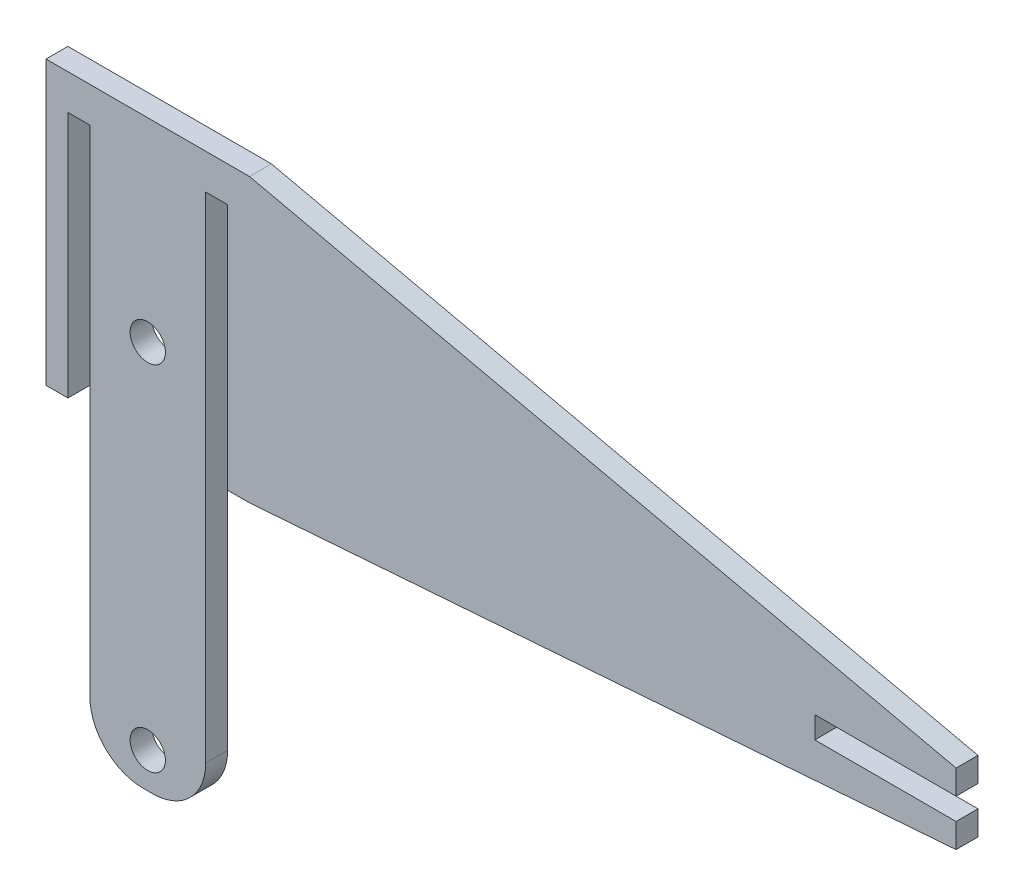
ISO-10303-21;
HEADER;
FILE_DESCRIPTION(('STEP AP214'),'2;1');
FILE_NAME('part.step','',(''),(''),'','','');
FILE_SCHEMA(('AUTOMOTIVE_DESIGN { 1 0 10303 214 1 1 1 1 }'));
ENDSEC;
DATA;
#1=APPLICATION_CONTEXT('core data for automotive mechanical design processes');
#2=APPLICATION_PROTOCOL_DEFINITION('international standard','automotive_design',2000,#1);
#3=PRODUCT_CONTEXT('',#1,'mechanical');
#4=PRODUCT('Part','Part','',(#3));
#5=PRODUCT_RELATED_PRODUCT_CATEGORY('part','',(#4));
#6=PRODUCT_DEFINITION_FORMATION('','',#4);
#7=PRODUCT_DEFINITION_CONTEXT('part definition',#1,'design');
#8=PRODUCT_DEFINITION('design','',#6,#7);
#9=PRODUCT_DEFINITION_SHAPE('','',#8);
#10=(LENGTH_UNIT() NAMED_UNIT(*) SI_UNIT(.MILLI.,.METRE.));
#11=(NAMED_UNIT(*) PLANE_ANGLE_UNIT() SI_UNIT($,.RADIAN.));
#12=(NAMED_UNIT(*) SI_UNIT($,.STERADIAN.) SOLID_ANGLE_UNIT());
#13=UNCERTAINTY_MEASURE_WITH_UNIT(LENGTH_MEASURE(1.E-05),#10,'distance_accuracy_value','');
#14=(GEOMETRIC_REPRESENTATION_CONTEXT(3) GLOBAL_UNCERTAINTY_ASSIGNED_CONTEXT((#13)) GLOBAL_UNIT_ASSIGNED_CONTEXT((#10,
#11,#12)) REPRESENTATION_CONTEXT('',''));
#15=CARTESIAN_POINT('',(0.,0.,0.));
#16=DIRECTION('',(0.,0.,1.));
#17=DIRECTION('',(1.,0.,0.));
#18=AXIS2_PLACEMENT_3D('',#15,#16,#17);
#19=CARTESIAN_POINT('',(-14.4,-20.,3.1));
#20=DIRECTION('',(0.,1.,0.));
#21=DIRECTION('',(0.,0.,1.));
#22=AXIS2_PLACEMENT_3D('',#19,#20,#21);
#23=PLANE('',#22);
#24=DIRECTION('',(1.,0.,0.));
#25=VECTOR('',#24,1.);
#26=CARTESIAN_POINT('',(-14.4,-20.,3.1));
#27=LINE('',#26,#25);
#28=CARTESIAN_POINT('',(11.3,-20.,3.1));
#29=VERTEX_POINT('',#28);
#30=CARTESIAN_POINT('',(14.4,-20.,3.1));
#31=VERTEX_POINT('',#30);
#32=EDGE_CURVE('E195',#29,#31,#27,.T.);
#33=ORIENTED_EDGE('',*,*,#32,.F.);
#34=DIRECTION('',(0.,0.,1.));
#35=VECTOR('',#34,1.);
#36=CARTESIAN_POINT('',(11.3,-20.,0.));
#37=LINE('',#36,#35);
#38=CARTESIAN_POINT('',(11.3,-20.,0.));
#39=VERTEX_POINT('',#38);
#40=EDGE_CURVE('E275',#39,#29,#37,.T.);
#41=ORIENTED_EDGE('',*,*,#40,.F.);
#42=DIRECTION('',(1.,0.,0.));
#43=VECTOR('',#42,1.);
#44=CARTESIAN_POINT('',(-14.4,-20.,0.));
#45=LINE('',#44,#43);
#46=CARTESIAN_POINT('',(14.4,-20.,0.));
#47=VERTEX_POINT('',#46);
#48=EDGE_CURVE('E319',#39,#47,#45,.T.);
#49=ORIENTED_EDGE('',*,*,#48,.T.);
#50=DIRECTION('',(0.,0.,-1.));
#51=VECTOR('',#50,1.);
#52=CARTESIAN_POINT('',(14.4,-20.,3.1));
#53=LINE('',#52,#51);
#54=EDGE_CURVE('E325',#31,#47,#53,.T.);
#55=ORIENTED_EDGE('',*,*,#54,.F.);
#56=EDGE_LOOP('',(#33,#41,#49,#55));
#57=FACE_BOUND('',#56,.T.);
#58=ADVANCED_FACE('F32',(#57),#23,.F.);
#59=CARTESIAN_POINT('',(-14.4,-20.,0.));
#60=VERTEX_POINT('',#59);
#61=CARTESIAN_POINT('',(-11.3,-20.,0.));
#62=VERTEX_POINT('',#61);
#63=EDGE_CURVE('E308',#60,#62,#45,.T.);
#64=ORIENTED_EDGE('',*,*,#63,.T.);
#65=DIRECTION('',(0.,0.,1.));
#66=VECTOR('',#65,1.);
#67=CARTESIAN_POINT('',(-11.3,-20.,0.));
#68=LINE('',#67,#66);
#69=CARTESIAN_POINT('',(-11.3,-20.,3.1));
#70=VERTEX_POINT('',#69);
#71=EDGE_CURVE('E290',#62,#70,#68,.T.);
#72=ORIENTED_EDGE('',*,*,#71,.T.);
#73=CARTESIAN_POINT('',(-14.4,-20.,3.1));
#74=VERTEX_POINT('',#73);
#75=EDGE_CURVE('E310',#74,#70,#27,.T.);
#76=ORIENTED_EDGE('',*,*,#75,.F.);
#77=DIRECTION('',(0.,0.,-1.));
#78=VECTOR('',#77,1.);
#79=CARTESIAN_POINT('',(-14.4,-20.,3.1));
#80=LINE('',#79,#78);
#81=EDGE_CURVE('E322',#74,#60,#80,.T.);
#82=ORIENTED_EDGE('',*,*,#81,.T.);
#83=EDGE_LOOP('',(#64,#72,#76,#82));
#84=FACE_BOUND('',#83,.T.);
#85=ADVANCED_FACE('F392',(#84),#23,.F.);
#86=CARTESIAN_POINT('',(-14.4,-20.,3.1));
#87=DIRECTION('',(-1.,0.,0.));
#88=DIRECTION('',(0.,0.,1.));
#89=AXIS2_PLACEMENT_3D('',#86,#87,#88);
#90=PLANE('',#89);
#91=DIRECTION('',(0.,1.,0.));
#92=VECTOR('',#91,1.);
#93=CARTESIAN_POINT('',(-14.4,-20.,0.));
#94=LINE('',#93,#92);
#95=CARTESIAN_POINT('',(-14.4,20.,0.));
#96=VERTEX_POINT('',#95);
#97=EDGE_CURVE('E298',#60,#96,#94,.T.);
#98=ORIENTED_EDGE('',*,*,#97,.F.);
#99=ORIENTED_EDGE('',*,*,#81,.F.);
#100=DIRECTION('',(0.,1.,0.));
#101=VECTOR('',#100,1.);
#102=CARTESIAN_POINT('',(-14.4,-20.,3.1));
#103=LINE('',#102,#101);
#104=CARTESIAN_POINT('',(-14.4,20.,3.1));
#105=VERTEX_POINT('',#104);
#106=EDGE_CURVE('E304',#74,#105,#103,.T.);
#107=ORIENTED_EDGE('',*,*,#106,.T.);
#108=DIRECTION('',(0.,0.,-1.));
#109=VECTOR('',#108,1.);
#110=CARTESIAN_POINT('',(-14.4,20.,3.1));
#111=LINE('',#110,#109);
#112=EDGE_CURVE('E313',#105,#96,#111,.T.);
#113=ORIENTED_EDGE('',*,*,#112,.T.);
#114=EDGE_LOOP('',(#98,#99,#107,#113));
#115=FACE_BOUND('',#114,.T.);
#116=ADVANCED_FACE('F386',(#115),#90,.T.);
#117=CARTESIAN_POINT('',(-14.4,20.,3.1));
#118=DIRECTION('',(0.,1.,0.));
#119=DIRECTION('',(0.,0.,1.));
#120=AXIS2_PLACEMENT_3D('',#117,#118,#119);
#121=PLANE('',#120);
#122=DIRECTION('',(1.,0.,0.));
#123=VECTOR('',#122,1.);
#124=CARTESIAN_POINT('',(-14.4,20.,0.));
#125=LINE('',#124,#123);
#126=CARTESIAN_POINT('',(14.4,20.,0.));
#127=VERTEX_POINT('',#126);
#128=EDGE_CURVE('E316',#96,#127,#125,.T.);
#129=ORIENTED_EDGE('',*,*,#128,.F.);
#130=ORIENTED_EDGE('',*,*,#112,.F.);
#131=DIRECTION('',(1.,0.,0.));
#132=VECTOR('',#131,1.);
#133=CARTESIAN_POINT('',(-14.4,20.,3.1));
#134=LINE('',#133,#132);
#135=CARTESIAN_POINT('',(14.4,20.,3.1));
#136=VERTEX_POINT('',#135);
#137=EDGE_CURVE('E307',#105,#136,#134,.T.);
#138=ORIENTED_EDGE('',*,*,#137,.T.);
#139=DIRECTION('',(0.,0.,-1.));
#140=VECTOR('',#139,1.);
#141=CARTESIAN_POINT('',(14.4,20.,3.1));
#142=LINE('',#141,#140);
#143=EDGE_CURVE('E327',#136,#127,#142,.T.);
#144=ORIENTED_EDGE('',*,*,#143,.T.);
#145=EDGE_LOOP('',(#129,#130,#138,#144));
#146=FACE_BOUND('',#145,.T.);
#147=ADVANCED_FACE('F382',(#146),#121,.T.);
#148=CARTESIAN_POINT('',(0.,0.,3.1));
#149=DIRECTION('',(0.,0.,-1.));
#150=DIRECTION('',(-1.,0.,0.));
#151=AXIS2_PLACEMENT_3D('',#148,#149,#150);
#152=PLANE('',#151);
#153=CARTESIAN_POINT('',(0.,-7.5,3.1));
#154=DIRECTION('',(0.,0.,1.));
#155=DIRECTION('',(1.,0.,0.));
#156=AXIS2_PLACEMENT_3D('',#153,#154,#155);
#157=CIRCLE('',#156,2.5);
#158=CARTESIAN_POINT('',(2.5,-7.5,3.1));
#159=VERTEX_POINT('',#158);
#160=EDGE_CURVE('E251',#159,#159,#157,.T.);
#161=ORIENTED_EDGE('',*,*,#160,.F.);
#162=EDGE_LOOP('',(#161));
#163=FACE_BOUND('',#162,.T.);
#164=DIRECTION('',(1.,0.,0.));
#165=VECTOR('',#164,1.);
#166=CARTESIAN_POINT('',(-8.19999999999999,-62.5,3.1));
#167=LINE('',#166,#165);
#168=CARTESIAN_POINT('',(-0.699999999999985,-62.5,3.1));
#169=VERTEX_POINT('',#168);
#170=CARTESIAN_POINT('',(0.699999999999982,-62.5,3.1));
#171=VERTEX_POINT('',#170);
#172=EDGE_CURVE('E245',#169,#171,#167,.T.);
#173=ORIENTED_EDGE('',*,*,#172,.T.);
#174=CARTESIAN_POINT('',(0.699999999999982,-55.,3.1));
#175=DIRECTION('',(0.,0.,-1.));
#176=DIRECTION('',(-1.,0.,0.));
#177=AXIS2_PLACEMENT_3D('',#174,#175,#176);
#178=CIRCLE('',#177,7.5);
#179=CARTESIAN_POINT('',(8.19999999999998,-55.,3.1));
#180=VERTEX_POINT('',#179);
#181=EDGE_CURVE('E336',#171,#180,#178,.F.);
#182=ORIENTED_EDGE('',*,*,#181,.T.);
#183=DIRECTION('',(0.,-1.,0.));
#184=VECTOR('',#183,1.);
#185=CARTESIAN_POINT('',(8.19999999999999,-20.,3.1));
#186=LINE('',#185,#184);
#187=CARTESIAN_POINT('',(8.2,15.,3.1));
#188=VERTEX_POINT('',#187);
#189=EDGE_CURVE('E263',#188,#180,#186,.T.);
#190=ORIENTED_EDGE('',*,*,#189,.F.);
#191=DIRECTION('',(-1.,0.,0.));
#192=VECTOR('',#191,1.);
#193=CARTESIAN_POINT('',(11.3,15.,3.1));
#194=LINE('',#193,#192);
#195=CARTESIAN_POINT('',(11.3,15.,3.1));
#196=VERTEX_POINT('',#195);
#197=EDGE_CURVE('E271',#196,#188,#194,.T.);
#198=ORIENTED_EDGE('',*,*,#197,.F.);
#199=DIRECTION('',(0.,1.,0.));
#200=VECTOR('',#199,1.);
#201=CARTESIAN_POINT('',(11.3,-20.,3.1));
#202=LINE('',#201,#200);
#203=EDGE_CURVE('E256',#29,#196,#202,.T.);
#204=ORIENTED_EDGE('',*,*,#203,.F.);
#205=ORIENTED_EDGE('',*,*,#32,.T.);
#206=DIRECTION('',(-0.997199309888456,-0.0747899482416341,0.));
#207=VECTOR('',#206,1.);
#208=CARTESIAN_POINT('',(114.4,-12.5,3.1));
#209=LINE('',#208,#207);
#210=CARTESIAN_POINT('',(114.4,-12.5,3.1));
#211=VERTEX_POINT('',#210);
#212=EDGE_CURVE('E175',#211,#31,#209,.T.);
#213=ORIENTED_EDGE('',*,*,#212,.F.);
#214=DIRECTION('',(0.,-1.,0.));
#215=VECTOR('',#214,1.);
#216=CARTESIAN_POINT('',(114.4,-9.05000000000002,3.1));
#217=LINE('',#216,#215);
#218=CARTESIAN_POINT('',(114.4,-9.05000000000002,3.1));
#219=VERTEX_POINT('',#218);
#220=EDGE_CURVE('E191',#219,#211,#217,.T.);
#221=ORIENTED_EDGE('',*,*,#220,.F.);
#222=DIRECTION('',(1.,0.,0.));
#223=VECTOR('',#222,1.);
#224=CARTESIAN_POINT('',(94.4,-9.05000000000001,3.1));
#225=LINE('',#224,#223);
#226=CARTESIAN_POINT('',(94.4,-9.05000000000001,3.1));
#227=VERTEX_POINT('',#226);
#228=EDGE_CURVE('E183',#227,#219,#225,.T.);
#229=ORIENTED_EDGE('',*,*,#228,.F.);
#230=DIRECTION('',(0.,-1.,0.));
#231=VECTOR('',#230,1.);
#232=CARTESIAN_POINT('',(94.4,-9.05000000000001,3.1));
#233=LINE('',#232,#231);
#234=CARTESIAN_POINT('',(94.4,-5.95000000000001,3.1));
#235=VERTEX_POINT('',#234);
#236=EDGE_CURVE('E215',#235,#227,#233,.T.);
#237=ORIENTED_EDGE('',*,*,#236,.F.);
#238=DIRECTION('',(-1.,0.,0.));
#239=VECTOR('',#238,1.);
#240=CARTESIAN_POINT('',(94.4,-5.95000000000001,3.1));
#241=LINE('',#240,#239);
#242=CARTESIAN_POINT('',(114.4,-5.95000000000002,3.1));
#243=VERTEX_POINT('',#242);
#244=EDGE_CURVE('E212',#243,#235,#241,.T.);
#245=ORIENTED_EDGE('',*,*,#244,.F.);
#246=DIRECTION('',(0.,-1.,0.));
#247=VECTOR('',#246,1.);
#248=CARTESIAN_POINT('',(114.4,-5.95000000000002,3.1));
#249=LINE('',#248,#247);
#250=CARTESIAN_POINT('',(114.4,-2.50000000000002,3.1));
#251=VERTEX_POINT('',#250);
#252=EDGE_CURVE('E209',#251,#243,#249,.T.);
#253=ORIENTED_EDGE('',*,*,#252,.F.);
#254=DIRECTION('',(0.975609756097561,-0.219512195121951,0.));
#255=VECTOR('',#254,1.);
#256=CARTESIAN_POINT('',(114.4,-2.50000000000002,3.1));
#257=LINE('',#256,#255);
#258=EDGE_CURVE('E197',#136,#251,#257,.T.);
#259=ORIENTED_EDGE('',*,*,#258,.F.);
#260=ORIENTED_EDGE('',*,*,#137,.F.);
#261=ORIENTED_EDGE('',*,*,#106,.F.);
#262=ORIENTED_EDGE('',*,*,#75,.T.);
#263=DIRECTION('',(0.,-1.,0.));
#264=VECTOR('',#263,1.);
#265=CARTESIAN_POINT('',(-11.3,-20.,3.1));
#266=LINE('',#265,#264);
#267=CARTESIAN_POINT('',(-11.3,15.,3.1));
#268=VERTEX_POINT('',#267);
#269=EDGE_CURVE('E277',#268,#70,#266,.T.);
#270=ORIENTED_EDGE('',*,*,#269,.F.);
#271=DIRECTION('',(-1.,0.,0.));
#272=VECTOR('',#271,1.);
#273=CARTESIAN_POINT('',(-11.3,15.,3.1));
#274=LINE('',#273,#272);
#275=CARTESIAN_POINT('',(-8.2,15.,3.1));
#276=VERTEX_POINT('',#275);
#277=EDGE_CURVE('E285',#276,#268,#274,.T.);
#278=ORIENTED_EDGE('',*,*,#277,.F.);
#279=DIRECTION('',(0.,1.,0.));
#280=VECTOR('',#279,1.);
#281=CARTESIAN_POINT('',(-8.19999999999999,-20.,3.1));
#282=LINE('',#281,#280);
#283=CARTESIAN_POINT('',(-8.19999999999998,-55.,3.1));
#284=VERTEX_POINT('',#283);
#285=EDGE_CURVE('E292',#284,#276,#282,.T.);
#286=ORIENTED_EDGE('',*,*,#285,.F.);
#287=CARTESIAN_POINT('',(-0.699999999999985,-55.,3.1));
#288=DIRECTION('',(0.,0.,-1.));
#289=DIRECTION('',(-1.,0.,0.));
#290=AXIS2_PLACEMENT_3D('',#287,#288,#289);
#291=CIRCLE('',#290,7.5);
#292=EDGE_CURVE('E334',#284,#169,#291,.F.);
#293=ORIENTED_EDGE('',*,*,#292,.T.);
#294=EDGE_LOOP('',(#173,#182,#190,#198,#204,#205,#213,#221,#229,#237,#245,#253,#259,#260,#261,
#262,#270,#278,#286,#293));
#295=FACE_BOUND('',#294,.T.);
#296=CARTESIAN_POINT('',(0.,-57.5,3.1));
#297=DIRECTION('',(0.,0.,1.));
#298=DIRECTION('',(1.,0.,0.));
#299=AXIS2_PLACEMENT_3D('',#296,#297,#298);
#300=CIRCLE('',#299,2.5);
#301=CARTESIAN_POINT('',(2.5,-57.5,3.1));
#302=VERTEX_POINT('',#301);
#303=EDGE_CURVE('E234',#302,#302,#300,.T.);
#304=ORIENTED_EDGE('',*,*,#303,.F.);
#305=EDGE_LOOP('',(#304));
#306=FACE_BOUND('',#305,.T.);
#307=ADVANCED_FACE('F188',(#163,#295,#306),#152,.F.);
#308=CARTESIAN_POINT('',(0.,0.,0.));
#309=DIRECTION('',(0.,0.,-1.));
#310=DIRECTION('',(-1.,0.,0.));
#311=AXIS2_PLACEMENT_3D('',#308,#309,#310);
#312=PLANE('',#311);
#313=CARTESIAN_POINT('',(0.,-7.5,0.));
#314=DIRECTION('',(0.,0.,1.));
#315=DIRECTION('',(1.,0.,0.));
#316=AXIS2_PLACEMENT_3D('',#313,#314,#315);
#317=CIRCLE('',#316,2.5);
#318=CARTESIAN_POINT('',(2.5,-7.5,0.));
#319=VERTEX_POINT('',#318);
#320=EDGE_CURVE('E253',#319,#319,#317,.T.);
#321=ORIENTED_EDGE('',*,*,#320,.T.);
#322=EDGE_LOOP('',(#321));
#323=FACE_BOUND('',#322,.T.);
#324=DIRECTION('',(0.,-1.,0.));
#325=VECTOR('',#324,1.);
#326=CARTESIAN_POINT('',(8.19999999999999,-20.,0.));
#327=LINE('',#326,#325);
#328=CARTESIAN_POINT('',(8.2,15.,0.));
#329=VERTEX_POINT('',#328);
#330=CARTESIAN_POINT('',(8.19999999999998,-55.,0.));
#331=VERTEX_POINT('',#330);
#332=EDGE_CURVE('E266',#329,#331,#327,.T.);
#333=ORIENTED_EDGE('',*,*,#332,.T.);
#334=CARTESIAN_POINT('',(0.699999999999982,-55.,0.));
#335=DIRECTION('',(0.,0.,-1.));
#336=DIRECTION('',(-1.,0.,0.));
#337=AXIS2_PLACEMENT_3D('',#334,#335,#336);
#338=CIRCLE('',#337,7.5);
#339=CARTESIAN_POINT('',(0.699999999999982,-62.5,0.));
#340=VERTEX_POINT('',#339);
#341=EDGE_CURVE('E40',#331,#340,#338,.T.);
#342=ORIENTED_EDGE('',*,*,#341,.T.);
#343=DIRECTION('',(1.,0.,0.));
#344=VECTOR('',#343,1.);
#345=CARTESIAN_POINT('',(-8.19999999999999,-62.5,0.));
#346=LINE('',#345,#344);
#347=CARTESIAN_POINT('',(-0.699999999999985,-62.5,0.));
#348=VERTEX_POINT('',#347);
#349=EDGE_CURVE('E248',#348,#340,#346,.T.);
#350=ORIENTED_EDGE('',*,*,#349,.F.);
#351=CARTESIAN_POINT('',(-0.699999999999985,-55.,0.));
#352=DIRECTION('',(0.,0.,-1.));
#353=DIRECTION('',(-1.,0.,0.));
#354=AXIS2_PLACEMENT_3D('',#351,#352,#353);
#355=CIRCLE('',#354,7.5);
#356=CARTESIAN_POINT('',(-8.19999999999998,-55.,0.));
#357=VERTEX_POINT('',#356);
#358=EDGE_CURVE('E47',#348,#357,#355,.T.);
#359=ORIENTED_EDGE('',*,*,#358,.T.);
#360=DIRECTION('',(0.,1.,0.));
#361=VECTOR('',#360,1.);
#362=CARTESIAN_POINT('',(-8.19999999999999,-20.,0.));
#363=LINE('',#362,#361);
#364=CARTESIAN_POINT('',(-8.2,15.,0.));
#365=VERTEX_POINT('',#364);
#366=EDGE_CURVE('E284',#357,#365,#363,.T.);
#367=ORIENTED_EDGE('',*,*,#366,.T.);
#368=DIRECTION('',(-1.,0.,0.));
#369=VECTOR('',#368,1.);
#370=CARTESIAN_POINT('',(-11.3,15.,0.));
#371=LINE('',#370,#369);
#372=CARTESIAN_POINT('',(-11.3,15.,0.));
#373=VERTEX_POINT('',#372);
#374=EDGE_CURVE('E287',#365,#373,#371,.T.);
#375=ORIENTED_EDGE('',*,*,#374,.T.);
#376=DIRECTION('',(0.,-1.,0.));
#377=VECTOR('',#376,1.);
#378=CARTESIAN_POINT('',(-11.3,-20.,0.));
#379=LINE('',#378,#377);
#380=EDGE_CURVE('E281',#373,#62,#379,.T.);
#381=ORIENTED_EDGE('',*,*,#380,.T.);
#382=ORIENTED_EDGE('',*,*,#63,.F.);
#383=ORIENTED_EDGE('',*,*,#97,.T.);
#384=ORIENTED_EDGE('',*,*,#128,.T.);
#385=DIRECTION('',(0.975609756097561,-0.219512195121951,0.));
#386=VECTOR('',#385,1.);
#387=CARTESIAN_POINT('',(114.4,-2.50000000000002,0.));
#388=LINE('',#387,#386);
#389=CARTESIAN_POINT('',(114.4,-2.50000000000002,0.));
#390=VERTEX_POINT('',#389);
#391=EDGE_CURVE('E222',#127,#390,#388,.T.);
#392=ORIENTED_EDGE('',*,*,#391,.T.);
#393=DIRECTION('',(0.,-1.,0.));
#394=VECTOR('',#393,1.);
#395=CARTESIAN_POINT('',(114.4,-5.95000000000002,0.));
#396=LINE('',#395,#394);
#397=CARTESIAN_POINT('',(114.4,-5.95000000000002,0.));
#398=VERTEX_POINT('',#397);
#399=EDGE_CURVE('E225',#390,#398,#396,.T.);
#400=ORIENTED_EDGE('',*,*,#399,.T.);
#401=DIRECTION('',(-1.,0.,0.));
#402=VECTOR('',#401,1.);
#403=CARTESIAN_POINT('',(94.4,-5.95000000000001,0.));
#404=LINE('',#403,#402);
#405=CARTESIAN_POINT('',(94.4,-5.95000000000001,0.));
#406=VERTEX_POINT('',#405);
#407=EDGE_CURVE('E228',#398,#406,#404,.T.);
#408=ORIENTED_EDGE('',*,*,#407,.T.);
#409=DIRECTION('',(0.,-1.,0.));
#410=VECTOR('',#409,1.);
#411=CARTESIAN_POINT('',(94.4,-9.05000000000001,0.));
#412=LINE('',#411,#410);
#413=CARTESIAN_POINT('',(94.4,-9.05000000000001,0.));
#414=VERTEX_POINT('',#413);
#415=EDGE_CURVE('E204',#406,#414,#412,.T.);
#416=ORIENTED_EDGE('',*,*,#415,.T.);
#417=DIRECTION('',(1.,0.,0.));
#418=VECTOR('',#417,1.);
#419=CARTESIAN_POINT('',(94.4,-9.05000000000001,0.));
#420=LINE('',#419,#418);
#421=CARTESIAN_POINT('',(114.4,-9.05000000000002,0.));
#422=VERTEX_POINT('',#421);
#423=EDGE_CURVE('E201',#414,#422,#420,.T.);
#424=ORIENTED_EDGE('',*,*,#423,.T.);
#425=DIRECTION('',(0.,-1.,0.));
#426=VECTOR('',#425,1.);
#427=CARTESIAN_POINT('',(114.4,-9.05000000000002,0.));
#428=LINE('',#427,#426);
#429=CARTESIAN_POINT('',(114.4,-12.5,0.));
#430=VERTEX_POINT('',#429);
#431=EDGE_CURVE('E219',#422,#430,#428,.T.);
#432=ORIENTED_EDGE('',*,*,#431,.T.);
#433=DIRECTION('',(-0.997199309888456,-0.0747899482416341,0.));
#434=VECTOR('',#433,1.);
#435=CARTESIAN_POINT('',(114.4,-12.5,0.));
#436=LINE('',#435,#434);
#437=EDGE_CURVE('E177',#430,#47,#436,.T.);
#438=ORIENTED_EDGE('',*,*,#437,.T.);
#439=ORIENTED_EDGE('',*,*,#48,.F.);
#440=DIRECTION('',(0.,1.,0.));
#441=VECTOR('',#440,1.);
#442=CARTESIAN_POINT('',(11.3,-20.,0.));
#443=LINE('',#442,#441);
#444=CARTESIAN_POINT('',(11.3,15.,0.));
#445=VERTEX_POINT('',#444);
#446=EDGE_CURVE('E259',#39,#445,#443,.T.);
#447=ORIENTED_EDGE('',*,*,#446,.T.);
#448=DIRECTION('',(-1.,0.,0.));
#449=VECTOR('',#448,1.);
#450=CARTESIAN_POINT('',(11.3,15.,0.));
#451=LINE('',#450,#449);
#452=EDGE_CURVE('E262',#445,#329,#451,.T.);
#453=ORIENTED_EDGE('',*,*,#452,.T.);
#454=EDGE_LOOP('',(#333,#342,#350,#359,#367,#375,#381,#382,#383,#384,#392,#400,#408,#416,#424,
#432,#438,#439,#447,#453));
#455=FACE_BOUND('',#454,.T.);
#456=CARTESIAN_POINT('',(0.,-57.5,0.));
#457=DIRECTION('',(0.,0.,1.));
#458=DIRECTION('',(1.,0.,0.));
#459=AXIS2_PLACEMENT_3D('',#456,#457,#458);
#460=CIRCLE('',#459,2.5);
#461=CARTESIAN_POINT('',(2.5,-57.5,0.));
#462=VERTEX_POINT('',#461);
#463=EDGE_CURVE('E242',#462,#462,#460,.T.);
#464=ORIENTED_EDGE('',*,*,#463,.T.);
#465=EDGE_LOOP('',(#464));
#466=FACE_BOUND('',#465,.T.);
#467=ADVANCED_FACE('F340',(#323,#455,#466),#312,.T.);
#468=CARTESIAN_POINT('',(-11.3,-20.,0.));
#469=DIRECTION('',(-1.,0.,0.));
#470=DIRECTION('',(0.,0.,1.));
#471=AXIS2_PLACEMENT_3D('',#468,#469,#470);
#472=PLANE('',#471);
#473=ORIENTED_EDGE('',*,*,#269,.T.);
#474=ORIENTED_EDGE('',*,*,#71,.F.);
#475=ORIENTED_EDGE('',*,*,#380,.F.);
#476=DIRECTION('',(0.,0.,1.));
#477=VECTOR('',#476,1.);
#478=CARTESIAN_POINT('',(-11.3,15.,0.));
#479=LINE('',#478,#477);
#480=EDGE_CURVE('E296',#373,#268,#479,.T.);
#481=ORIENTED_EDGE('',*,*,#480,.T.);
#482=EDGE_LOOP('',(#473,#474,#475,#481));
#483=FACE_BOUND('',#482,.T.);
#484=ADVANCED_FACE('F395',(#483),#472,.F.);
#485=CARTESIAN_POINT('',(-11.3,15.,0.));
#486=DIRECTION('',(0.,1.,0.));
#487=DIRECTION('',(0.,0.,1.));
#488=AXIS2_PLACEMENT_3D('',#485,#486,#487);
#489=PLANE('',#488);
#490=ORIENTED_EDGE('',*,*,#277,.T.);
#491=ORIENTED_EDGE('',*,*,#480,.F.);
#492=ORIENTED_EDGE('',*,*,#374,.F.);
#493=DIRECTION('',(0.,0.,1.));
#494=VECTOR('',#493,1.);
#495=CARTESIAN_POINT('',(-8.2,15.,0.));
#496=LINE('',#495,#494);
#497=EDGE_CURVE('E299',#365,#276,#496,.T.);
#498=ORIENTED_EDGE('',*,*,#497,.T.);
#499=EDGE_LOOP('',(#490,#491,#492,#498));
#500=FACE_BOUND('',#499,.T.);
#501=ADVANCED_FACE('F399',(#500),#489,.F.);
#502=CARTESIAN_POINT('',(-8.19999999999999,-20.,0.));
#503=DIRECTION('',(1.,0.,0.));
#504=DIRECTION('',(0.,1.,0.));
#505=AXIS2_PLACEMENT_3D('',#502,#503,#504);
#506=PLANE('',#505);
#507=ORIENTED_EDGE('',*,*,#366,.F.);
#508=DIRECTION('',(0.,0.,1.));
#509=VECTOR('',#508,1.);
#510=CARTESIAN_POINT('',(-8.19999999999998,-55.,3.1));
#511=LINE('',#510,#509);
#512=EDGE_CURVE('E11',#357,#284,#511,.T.);
#513=ORIENTED_EDGE('',*,*,#512,.T.);
#514=ORIENTED_EDGE('',*,*,#285,.T.);
#515=ORIENTED_EDGE('',*,*,#497,.F.);
#516=EDGE_LOOP('',(#507,#513,#514,#515));
#517=FACE_BOUND('',#516,.T.);
#518=ADVANCED_FACE('F401',(#517),#506,.F.);
#519=CARTESIAN_POINT('',(11.3,-20.,0.));
#520=DIRECTION('',(1.,0.,0.));
#521=DIRECTION('',(0.,0.,-1.));
#522=AXIS2_PLACEMENT_3D('',#519,#520,#521);
#523=PLANE('',#522);
#524=ORIENTED_EDGE('',*,*,#203,.T.);
#525=DIRECTION('',(0.,0.,1.));
#526=VECTOR('',#525,1.);
#527=CARTESIAN_POINT('',(11.3,15.,0.));
#528=LINE('',#527,#526);
#529=EDGE_CURVE('E268',#445,#196,#528,.T.);
#530=ORIENTED_EDGE('',*,*,#529,.F.);
#531=ORIENTED_EDGE('',*,*,#446,.F.);
#532=ORIENTED_EDGE('',*,*,#40,.T.);
#533=EDGE_LOOP('',(#524,#530,#531,#532));
#534=FACE_BOUND('',#533,.T.);
#535=ADVANCED_FACE('F463',(#534),#523,.F.);
#536=CARTESIAN_POINT('',(8.19999999999999,-20.,0.));
#537=DIRECTION('',(-1.,0.,0.));
#538=DIRECTION('',(0.,-1.,0.));
#539=AXIS2_PLACEMENT_3D('',#536,#537,#538);
#540=PLANE('',#539);
#541=ORIENTED_EDGE('',*,*,#189,.T.);
#542=DIRECTION('',(0.,0.,1.));
#543=VECTOR('',#542,1.);
#544=CARTESIAN_POINT('',(8.19999999999998,-55.,0.));
#545=LINE('',#544,#543);
#546=EDGE_CURVE('E55',#180,#331,#545,.F.);
#547=ORIENTED_EDGE('',*,*,#546,.T.);
#548=ORIENTED_EDGE('',*,*,#332,.F.);
#549=DIRECTION('',(0.,0.,1.));
#550=VECTOR('',#549,1.);
#551=CARTESIAN_POINT('',(8.2,15.,0.));
#552=LINE('',#551,#550);
#553=EDGE_CURVE('E278',#329,#188,#552,.T.);
#554=ORIENTED_EDGE('',*,*,#553,.T.);
#555=EDGE_LOOP('',(#541,#547,#548,#554));
#556=FACE_BOUND('',#555,.T.);
#557=ADVANCED_FACE('F351',(#556),#540,.F.);
#558=CARTESIAN_POINT('',(11.3,15.,0.));
#559=DIRECTION('',(0.,1.,0.));
#560=DIRECTION('',(0.,0.,1.));
#561=AXIS2_PLACEMENT_3D('',#558,#559,#560);
#562=PLANE('',#561);
#563=ORIENTED_EDGE('',*,*,#197,.T.);
#564=ORIENTED_EDGE('',*,*,#553,.F.);
#565=ORIENTED_EDGE('',*,*,#452,.F.);
#566=ORIENTED_EDGE('',*,*,#529,.T.);
#567=EDGE_LOOP('',(#563,#564,#565,#566));
#568=FACE_BOUND('',#567,.T.);
#569=ADVANCED_FACE('F355',(#568),#562,.F.);
#570=CARTESIAN_POINT('',(0.,-7.5,0.));
#571=DIRECTION('',(0.,0.,1.));
#572=DIRECTION('',(1.,0.,0.));
#573=AXIS2_PLACEMENT_3D('',#570,#571,#572);
#574=CYLINDRICAL_SURFACE('',#573,2.5);
#575=ORIENTED_EDGE('',*,*,#320,.F.);
#576=EDGE_LOOP('',(#575));
#577=FACE_BOUND('',#576,.T.);
#578=ORIENTED_EDGE('',*,*,#160,.T.);
#579=EDGE_LOOP('',(#578));
#580=FACE_BOUND('',#579,.T.);
#581=ADVANCED_FACE('F483',(#577,#580),#574,.F.);
#582=CARTESIAN_POINT('',(-8.19999999999999,-62.5,0.));
#583=DIRECTION('',(0.,-1.,0.));
#584=DIRECTION('',(0.,0.,-1.));
#585=AXIS2_PLACEMENT_3D('',#582,#583,#584);
#586=PLANE('',#585);
#587=ORIENTED_EDGE('',*,*,#349,.T.);
#588=DIRECTION('',(0.,0.,1.));
#589=VECTOR('',#588,1.);
#590=CARTESIAN_POINT('',(0.699999999999982,-62.5,3.1));
#591=LINE('',#590,#589);
#592=EDGE_CURVE('E331',#340,#171,#591,.T.);
#593=ORIENTED_EDGE('',*,*,#592,.T.);
#594=ORIENTED_EDGE('',*,*,#172,.F.);
#595=DIRECTION('',(0.,0.,1.));
#596=VECTOR('',#595,1.);
#597=CARTESIAN_POINT('',(-0.699999999999985,-62.5,0.));
#598=LINE('',#597,#596);
#599=EDGE_CURVE('E324',#169,#348,#598,.F.);
#600=ORIENTED_EDGE('',*,*,#599,.T.);
#601=EDGE_LOOP('',(#587,#593,#594,#600));
#602=FACE_BOUND('',#601,.T.);
#603=ADVANCED_FACE('F345',(#602),#586,.T.);
#604=CARTESIAN_POINT('',(0.,-57.5,0.));
#605=DIRECTION('',(0.,0.,1.));
#606=DIRECTION('',(1.,0.,0.));
#607=AXIS2_PLACEMENT_3D('',#604,#605,#606);
#608=CYLINDRICAL_SURFACE('',#607,2.5);
#609=ORIENTED_EDGE('',*,*,#463,.F.);
#610=EDGE_LOOP('',(#609));
#611=FACE_BOUND('',#610,.T.);
#612=ORIENTED_EDGE('',*,*,#303,.T.);
#613=EDGE_LOOP('',(#612));
#614=FACE_BOUND('',#613,.T.);
#615=ADVANCED_FACE('F411',(#611,#614),#608,.F.);
#616=CARTESIAN_POINT('',(0.699999999999982,-55.,0.));
#617=DIRECTION('',(0.,0.,-1.));
#618=DIRECTION('',(-1.,0.,0.));
#619=AXIS2_PLACEMENT_3D('',#616,#617,#618);
#620=CYLINDRICAL_SURFACE('',#619,7.5);
#621=ORIENTED_EDGE('',*,*,#341,.F.);
#622=ORIENTED_EDGE('',*,*,#546,.F.);
#623=ORIENTED_EDGE('',*,*,#181,.F.);
#624=ORIENTED_EDGE('',*,*,#592,.F.);
#625=EDGE_LOOP('',(#621,#622,#623,#624));
#626=FACE_BOUND('',#625,.T.);
#627=ADVANCED_FACE('F348',(#626),#620,.T.);
#628=CARTESIAN_POINT('',(-0.699999999999985,-55.,0.));
#629=DIRECTION('',(0.,0.,-1.));
#630=DIRECTION('',(-1.,0.,0.));
#631=AXIS2_PLACEMENT_3D('',#628,#629,#630);
#632=CYLINDRICAL_SURFACE('',#631,7.5);
#633=ORIENTED_EDGE('',*,*,#358,.F.);
#634=ORIENTED_EDGE('',*,*,#599,.F.);
#635=ORIENTED_EDGE('',*,*,#292,.F.);
#636=ORIENTED_EDGE('',*,*,#512,.F.);
#637=EDGE_LOOP('',(#633,#634,#635,#636));
#638=FACE_BOUND('',#637,.T.);
#639=ADVANCED_FACE('F34',(#638),#632,.T.);
#640=CARTESIAN_POINT('',(114.4,-9.05000000000002,3.1));
#641=DIRECTION('',(1.,0.,0.));
#642=DIRECTION('',(0.,0.,-1.));
#643=AXIS2_PLACEMENT_3D('',#640,#641,#642);
#644=PLANE('',#643);
#645=ORIENTED_EDGE('',*,*,#431,.F.);
#646=DIRECTION('',(0.,0.,-1.));
#647=VECTOR('',#646,1.);
#648=CARTESIAN_POINT('',(114.4,-9.05000000000002,3.1));
#649=LINE('',#648,#647);
#650=EDGE_CURVE('E200',#219,#422,#649,.T.);
#651=ORIENTED_EDGE('',*,*,#650,.F.);
#652=ORIENTED_EDGE('',*,*,#220,.T.);
#653=DIRECTION('',(0.,0.,-1.));
#654=VECTOR('',#653,1.);
#655=CARTESIAN_POINT('',(114.4,-12.5,3.1));
#656=LINE('',#655,#654);
#657=EDGE_CURVE('E171',#211,#430,#656,.T.);
#658=ORIENTED_EDGE('',*,*,#657,.T.);
#659=EDGE_LOOP('',(#645,#651,#652,#658));
#660=FACE_BOUND('',#659,.T.);
#661=ADVANCED_FACE('F199',(#660),#644,.T.);
#662=CARTESIAN_POINT('',(94.4,-9.05000000000001,3.1));
#663=DIRECTION('',(0.,1.,0.));
#664=DIRECTION('',(-1.,0.,0.));
#665=AXIS2_PLACEMENT_3D('',#662,#663,#664);
#666=PLANE('',#665);
#667=ORIENTED_EDGE('',*,*,#423,.F.);
#668=DIRECTION('',(0.,0.,-1.));
#669=VECTOR('',#668,1.);
#670=CARTESIAN_POINT('',(94.4,-9.05000000000001,3.1));
#671=LINE('',#670,#669);
#672=EDGE_CURVE('E235',#227,#414,#671,.T.);
#673=ORIENTED_EDGE('',*,*,#672,.F.);
#674=ORIENTED_EDGE('',*,*,#228,.T.);
#675=ORIENTED_EDGE('',*,*,#650,.T.);
#676=EDGE_LOOP('',(#667,#673,#674,#675));
#677=FACE_BOUND('',#676,.T.);
#678=ADVANCED_FACE('F363',(#677),#666,.T.);
#679=CARTESIAN_POINT('',(94.4,-9.05000000000001,3.1));
#680=DIRECTION('',(1.,0.,0.));
#681=DIRECTION('',(0.,0.,-1.));
#682=AXIS2_PLACEMENT_3D('',#679,#680,#681);
#683=PLANE('',#682);
#684=ORIENTED_EDGE('',*,*,#415,.F.);
#685=DIRECTION('',(0.,0.,-1.));
#686=VECTOR('',#685,1.);
#687=CARTESIAN_POINT('',(94.4,-5.95000000000001,3.1));
#688=LINE('',#687,#686);
#689=EDGE_CURVE('E237',#235,#406,#688,.T.);
#690=ORIENTED_EDGE('',*,*,#689,.F.);
#691=ORIENTED_EDGE('',*,*,#236,.T.);
#692=ORIENTED_EDGE('',*,*,#672,.T.);
#693=EDGE_LOOP('',(#684,#690,#691,#692));
#694=FACE_BOUND('',#693,.T.);
#695=ADVANCED_FACE('F567',(#694),#683,.T.);
#696=CARTESIAN_POINT('',(94.4,-5.95000000000001,3.1));
#697=DIRECTION('',(0.,-1.,0.));
#698=DIRECTION('',(1.,0.,0.));
#699=AXIS2_PLACEMENT_3D('',#696,#697,#698);
#700=PLANE('',#699);
#701=ORIENTED_EDGE('',*,*,#407,.F.);
#702=DIRECTION('',(0.,0.,-1.));
#703=VECTOR('',#702,1.);
#704=CARTESIAN_POINT('',(114.4,-5.95000000000002,3.1));
#705=LINE('',#704,#703);
#706=EDGE_CURVE('E239',#243,#398,#705,.T.);
#707=ORIENTED_EDGE('',*,*,#706,.F.);
#708=ORIENTED_EDGE('',*,*,#244,.T.);
#709=ORIENTED_EDGE('',*,*,#689,.T.);
#710=EDGE_LOOP('',(#701,#707,#708,#709));
#711=FACE_BOUND('',#710,.T.);
#712=ADVANCED_FACE('F370',(#711),#700,.T.);
#713=CARTESIAN_POINT('',(114.4,-5.95000000000002,3.1));
#714=DIRECTION('',(1.,0.,0.));
#715=DIRECTION('',(0.,0.,-1.));
#716=AXIS2_PLACEMENT_3D('',#713,#714,#715);
#717=PLANE('',#716);
#718=ORIENTED_EDGE('',*,*,#399,.F.);
#719=DIRECTION('',(0.,0.,-1.));
#720=VECTOR('',#719,1.);
#721=CARTESIAN_POINT('',(114.4,-2.50000000000002,3.1));
#722=LINE('',#721,#720);
#723=EDGE_CURVE('E182',#251,#390,#722,.T.);
#724=ORIENTED_EDGE('',*,*,#723,.F.);
#725=ORIENTED_EDGE('',*,*,#252,.T.);
#726=ORIENTED_EDGE('',*,*,#706,.T.);
#727=EDGE_LOOP('',(#718,#724,#725,#726));
#728=FACE_BOUND('',#727,.T.);
#729=ADVANCED_FACE('F373',(#728),#717,.T.);
#730=CARTESIAN_POINT('',(114.4,-2.50000000000002,3.1));
#731=DIRECTION('',(0.219512195121951,0.975609756097561,0.));
#732=DIRECTION('',(-0.975609756097561,0.219512195121951,0.));
#733=AXIS2_PLACEMENT_3D('',#730,#731,#732);
#734=PLANE('',#733);
#735=ORIENTED_EDGE('',*,*,#391,.F.);
#736=ORIENTED_EDGE('',*,*,#143,.F.);
#737=ORIENTED_EDGE('',*,*,#258,.T.);
#738=ORIENTED_EDGE('',*,*,#723,.T.);
#739=EDGE_LOOP('',(#735,#736,#737,#738));
#740=FACE_BOUND('',#739,.T.);
#741=ADVANCED_FACE('F379',(#740),#734,.T.);
#742=CARTESIAN_POINT('',(114.4,-12.5,3.1));
#743=DIRECTION('',(0.0747899482416341,-0.997199309888456,0.));
#744=DIRECTION('',(0.997199309888457,0.0747899482416341,0.));
#745=AXIS2_PLACEMENT_3D('',#742,#743,#744);
#746=PLANE('',#745);
#747=ORIENTED_EDGE('',*,*,#437,.F.);
#748=ORIENTED_EDGE('',*,*,#657,.F.);
#749=ORIENTED_EDGE('',*,*,#212,.T.);
#750=ORIENTED_EDGE('',*,*,#54,.T.);
#751=EDGE_LOOP('',(#747,#748,#749,#750));
#752=FACE_BOUND('',#751,.T.);
#753=ADVANCED_FACE('F173',(#752),#746,.T.);
#754=CLOSED_SHELL('',(#58,#85,#116,#147,#307,#467,#484,#501,#518,#535,#557,#569,#581,#603,#615,
#627,#639,#661,#678,#695,#712,#729,#741,#753));
#755=MANIFOLD_SOLID_BREP('B2',#754);
#756=ADVANCED_BREP_SHAPE_REPRESENTATION('',(#18,#755),#14);
#757=SHAPE_DEFINITION_REPRESENTATION(#9,#756);
ENDSEC;
END-ISO-10303-21;
